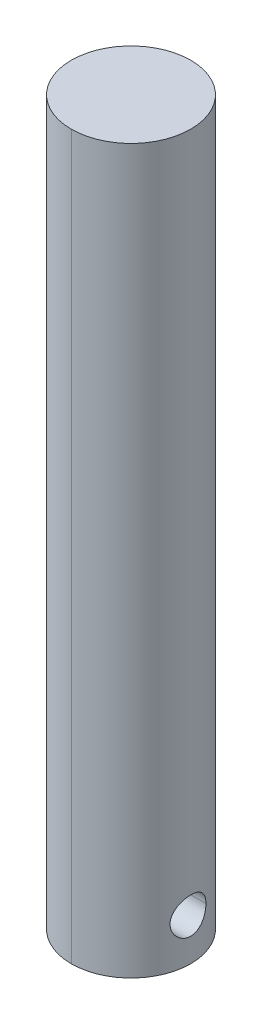
ISO-10303-21;
HEADER;
FILE_DESCRIPTION(('STEP AP214'),'2;1');
FILE_NAME('part.step','',(''),(''),'','','');
FILE_SCHEMA(('AUTOMOTIVE_DESIGN { 1 0 10303 214 1 1 1 1 }'));
ENDSEC;
DATA;
#1=APPLICATION_CONTEXT('core data for automotive mechanical design processes');
#2=APPLICATION_PROTOCOL_DEFINITION('international standard','automotive_design',2000,#1);
#3=PRODUCT_CONTEXT('',#1,'mechanical');
#4=PRODUCT('Part','Part','',(#3));
#5=PRODUCT_RELATED_PRODUCT_CATEGORY('part','',(#4));
#6=PRODUCT_DEFINITION_FORMATION('','',#4);
#7=PRODUCT_DEFINITION_CONTEXT('part definition',#1,'design');
#8=PRODUCT_DEFINITION('design','',#6,#7);
#9=PRODUCT_DEFINITION_SHAPE('','',#8);
#10=(LENGTH_UNIT() NAMED_UNIT(*) SI_UNIT(.MILLI.,.METRE.));
#11=(NAMED_UNIT(*) PLANE_ANGLE_UNIT() SI_UNIT($,.RADIAN.));
#12=(NAMED_UNIT(*) SI_UNIT($,.STERADIAN.) SOLID_ANGLE_UNIT());
#13=UNCERTAINTY_MEASURE_WITH_UNIT(LENGTH_MEASURE(1.E-05),#10,'distance_accuracy_value','');
#14=(GEOMETRIC_REPRESENTATION_CONTEXT(3) GLOBAL_UNCERTAINTY_ASSIGNED_CONTEXT((#13)) GLOBAL_UNIT_ASSIGNED_CONTEXT((#10,
#11,#12)) REPRESENTATION_CONTEXT('',''));
#15=CARTESIAN_POINT('',(0.,0.,0.));
#16=DIRECTION('',(0.,0.,1.));
#17=DIRECTION('',(1.,0.,0.));
#18=AXIS2_PLACEMENT_3D('',#15,#16,#17);
#19=CARTESIAN_POINT('',(-10.001,7.,0.));
#20=DIRECTION('',(1.,0.,0.));
#21=DIRECTION('',(0.,0.,-1.));
#22=AXIS2_PLACEMENT_3D('',#19,#20,#21);
#23=CYLINDRICAL_SURFACE('',#22,3.);
#24=DIRECTION('',(1.,0.,0.));
#25=VECTOR('',#24,1.);
#26=CARTESIAN_POINT('',(-10.001,7.,3.));
#27=LINE('',#26,#25);
#28=CARTESIAN_POINT('',(-9.53939201416946,7.,3.));
#29=VERTEX_POINT('',#28);
#30=CARTESIAN_POINT('',(9.53939201416946,7.,3.));
#31=VERTEX_POINT('',#30);
#32=EDGE_CURVE('E82',#29,#31,#27,.T.);
#33=ORIENTED_EDGE('',*,*,#32,.F.);
#34=CARTESIAN_POINT('',(-9.53939201416946,7.,3.));
#35=CARTESIAN_POINT('',(-9.53938054248207,7.08233552082269,3.00001027845728));
#36=CARTESIAN_POINT('',(-9.54045772064378,7.16466445506322,2.99661062684472));
#37=CARTESIAN_POINT('',(-9.54470412105986,7.32869395276546,2.98307142899347));
#38=CARTESIAN_POINT('',(-9.54787287296848,7.41039465332436,2.97293339805418));
#39=CARTESIAN_POINT('',(-9.55620668351003,7.57238491567317,2.94603140625045));
#40=CARTESIAN_POINT('',(-9.56136667250114,7.65267752404303,2.92928426957737));
#41=CARTESIAN_POINT('',(-9.57351626651178,7.81147584413423,2.88932853030395));
#42=CARTESIAN_POINT('',(-9.58050591937828,7.8899815090674,2.86611975872641));
#43=CARTESIAN_POINT('',(-9.60391637654137,8.12194938799015,2.78708584446024));
#44=CARTESIAN_POINT('',(-9.62279007830391,8.27206843883301,2.72181852542972));
#45=CARTESIAN_POINT('',(-9.66493213967819,8.55922604397904,2.56815043531276));
#46=CARTESIAN_POINT('',(-9.6882025429064,8.69625847076217,2.4797388992416));
#47=CARTESIAN_POINT('',(-9.73733650515374,8.95772298794783,2.27929879634442));
#48=CARTESIAN_POINT('',(-9.76325505469874,9.08168487406091,2.16666914746584));
#49=CARTESIAN_POINT('',(-9.81429628475077,9.30927361483876,1.92227736150433));
#50=CARTESIAN_POINT('',(-9.8394188301941,9.41289703386101,1.79051199848164));
#51=CARTESIAN_POINT('',(-9.88666477976534,9.59892686509456,1.50821997465697));
#52=CARTESIAN_POINT('',(-9.90871541546877,9.68085017978262,1.35736167401016));
#53=CARTESIAN_POINT('',(-9.94668940088144,9.81797700400293,1.04324233568303));
#54=CARTESIAN_POINT('',(-9.96261433032403,9.87318740336795,0.879984508687985));
#55=CARTESIAN_POINT('',(-9.98615279768398,9.953759551791,0.550649404820602));
#56=CARTESIAN_POINT('',(-9.99399098526792,9.97992970351762,0.384786253016204));
#57=CARTESIAN_POINT('',(-10.0012640407204,10.004234695146,0.0508471415689285));
#58=CARTESIAN_POINT('',(-10.0007004995012,10.0023748426782,-0.117228393125338));
#59=CARTESIAN_POINT('',(-9.99139205125586,9.97121417930856,-0.445143199271824));
#60=CARTESIAN_POINT('',(-9.98290831016512,9.94278930919189,-0.605074290763027));
#61=CARTESIAN_POINT('',(-9.95903027401822,9.86073673037451,-0.917780104370313));
#62=CARTESIAN_POINT('',(-9.94363561692558,9.80710770131733,-1.07055445110879));
#63=CARTESIAN_POINT('',(-9.90730429851782,9.67557555647525,-1.36669563173912));
#64=CARTESIAN_POINT('',(-9.88630511384915,9.59739671122391,-1.50993201207612));
#65=CARTESIAN_POINT('',(-9.84099249303647,9.41920281996559,-1.781531059161));
#66=CARTESIAN_POINT('',(-9.81667831471806,9.3191828810593,-1.9098903832325));
#67=CARTESIAN_POINT('',(-9.7662334714278,9.09561602381536,-2.15330901082205));
#68=CARTESIAN_POINT('',(-9.74006890899097,8.97131227247379,-2.26766702955975));
#69=CARTESIAN_POINT('',(-9.68968430229327,8.70500515314889,-2.47413538985067));
#70=CARTESIAN_POINT('',(-9.66546482675134,8.56299663927022,-2.5662392402618));
#71=CARTESIAN_POINT('',(-9.62154457591303,8.26343814310014,-2.72632814481701));
#72=CARTESIAN_POINT('',(-9.60189192491895,8.10574564081286,-2.79406012682263));
#73=CARTESIAN_POINT('',(-9.56991327306402,7.78055099203685,-2.90171772009404));
#74=CARTESIAN_POINT('',(-9.55757606951749,7.61306427857132,-2.94168586436072));
#75=CARTESIAN_POINT('',(-9.54628064650012,7.3700102218596,-2.97802407180159));
#76=CARTESIAN_POINT('',(-9.54370312550533,7.29621853164078,-2.98626405978017));
#77=CARTESIAN_POINT('',(-9.54025857223564,7.14829704180096,-2.99724711229708));
#78=CARTESIAN_POINT('',(-9.53938902493288,7.07416790067231,-2.99999825936538));
#79=CARTESIAN_POINT('',(-9.53939201416946,7.,-3.));
#80=B_SPLINE_CURVE_WITH_KNOTS('',3,(#34,#35,#36,#37,#38,#39,#40,#41,#42,#43,#44,#45,#46,#47,#48,
#49,#50,#51,#52,#53,#54,#55,#56,#57,#58,#59,#60,#61,#62,#63,#64,#65,#66,#67,#68,#69,#70,#71,#72,
#73,#74,#75,#76,#77,#78,#79),.UNSPECIFIED.,.F.,.F.,(4,2,2,2,2,2,2,2,2,2,2,2,2,2,2,2,2,2,2,2,2,2,
4),(0.,0.246918142439467,0.493780777706084,0.740019009623011,0.986263681482024,1.47813347402025,
1.97023245590779,2.47635119822766,2.98255536239033,3.4992281062007,4.01576751791672,
4.51753600864764,5.01920948804101,5.50490358251093,5.99062312360831,6.48200583350621,
6.9734987373917,7.48389234847122,7.99443465298715,8.51013494368214,9.02504345105574,
9.24774267716777,9.47011372732391),.UNSPECIFIED.);
#81=CARTESIAN_POINT('',(-9.53939201416946,7.,-3.));
#82=VERTEX_POINT('',#81);
#83=EDGE_CURVE('E11',#29,#82,#80,.T.);
#84=ORIENTED_EDGE('',*,*,#83,.T.);
#85=DIRECTION('',(1.,0.,0.));
#86=VECTOR('',#85,1.);
#87=CARTESIAN_POINT('',(-10.001,7.,-3.));
#88=LINE('',#87,#86);
#89=CARTESIAN_POINT('',(9.53939201416946,7.,-3.));
#90=VERTEX_POINT('',#89);
#91=EDGE_CURVE('E91',#82,#90,#88,.T.);
#92=ORIENTED_EDGE('',*,*,#91,.T.);
#93=CARTESIAN_POINT('',(9.53939201416946,7.,3.));
#94=CARTESIAN_POINT('',(9.53938054248207,7.08233552082269,3.00001027845728));
#95=CARTESIAN_POINT('',(9.54045772064378,7.16466445506322,2.99661062684472));
#96=CARTESIAN_POINT('',(9.54470412105986,7.32869395276546,2.98307142899347));
#97=CARTESIAN_POINT('',(9.54787287296848,7.41039465332436,2.97293339805418));
#98=CARTESIAN_POINT('',(9.55620668351003,7.57238491567317,2.94603140625045));
#99=CARTESIAN_POINT('',(9.56136667250114,7.65267752404303,2.92928426957737));
#100=CARTESIAN_POINT('',(9.57351626651178,7.81147584413423,2.88932853030395));
#101=CARTESIAN_POINT('',(9.58050591937828,7.8899815090674,2.86611975872641));
#102=CARTESIAN_POINT('',(9.60391637654137,8.12194938799015,2.78708584446024));
#103=CARTESIAN_POINT('',(9.62279007830391,8.27206843883301,2.72181852542972));
#104=CARTESIAN_POINT('',(9.66493213967819,8.55922604397904,2.56815043531276));
#105=CARTESIAN_POINT('',(9.6882025429064,8.69625847076217,2.4797388992416));
#106=CARTESIAN_POINT('',(9.73733650515374,8.95772298794783,2.27929879634442));
#107=CARTESIAN_POINT('',(9.76325505469874,9.08168487406091,2.16666914746584));
#108=CARTESIAN_POINT('',(9.81429628475077,9.30927361483876,1.92227736150433));
#109=CARTESIAN_POINT('',(9.8394188301941,9.41289703386101,1.79051199848164));
#110=CARTESIAN_POINT('',(9.88666477976534,9.59892686509456,1.50821997465697));
#111=CARTESIAN_POINT('',(9.90871541546877,9.68085017978262,1.35736167401016));
#112=CARTESIAN_POINT('',(9.94668940088144,9.81797700400293,1.04324233568303));
#113=CARTESIAN_POINT('',(9.96261433032403,9.87318740336795,0.879984508687985));
#114=CARTESIAN_POINT('',(9.98615279768398,9.953759551791,0.550649404820602));
#115=CARTESIAN_POINT('',(9.99399098526792,9.97992970351762,0.384786253016204));
#116=CARTESIAN_POINT('',(10.0012640407204,10.004234695146,0.0508471415689285));
#117=CARTESIAN_POINT('',(10.0007004995012,10.0023748426782,-0.117228393125338));
#118=CARTESIAN_POINT('',(9.99139205125586,9.97121417930856,-0.445143199271824));
#119=CARTESIAN_POINT('',(9.98290831016512,9.94278930919189,-0.605074290763027));
#120=CARTESIAN_POINT('',(9.95903027401822,9.86073673037451,-0.917780104370313));
#121=CARTESIAN_POINT('',(9.94363561692558,9.80710770131733,-1.07055445110879));
#122=CARTESIAN_POINT('',(9.90730429851782,9.67557555647525,-1.36669563173912));
#123=CARTESIAN_POINT('',(9.88630511384915,9.59739671122391,-1.50993201207612));
#124=CARTESIAN_POINT('',(9.84099249303647,9.41920281996559,-1.781531059161));
#125=CARTESIAN_POINT('',(9.81667831471806,9.3191828810593,-1.9098903832325));
#126=CARTESIAN_POINT('',(9.7662334714278,9.09561602381536,-2.15330901082205));
#127=CARTESIAN_POINT('',(9.74006890899097,8.97131227247379,-2.26766702955975));
#128=CARTESIAN_POINT('',(9.68968430229327,8.70500515314889,-2.47413538985067));
#129=CARTESIAN_POINT('',(9.66546482675134,8.56299663927022,-2.5662392402618));
#130=CARTESIAN_POINT('',(9.62154457591303,8.26343814310014,-2.72632814481701));
#131=CARTESIAN_POINT('',(9.60189192491895,8.10574564081286,-2.79406012682263));
#132=CARTESIAN_POINT('',(9.56991327306402,7.78055099203685,-2.90171772009404));
#133=CARTESIAN_POINT('',(9.55757606951749,7.61306427857132,-2.94168586436072));
#134=CARTESIAN_POINT('',(9.54628064650012,7.3700102218596,-2.97802407180159));
#135=CARTESIAN_POINT('',(9.54370312550533,7.29621853164078,-2.98626405978017));
#136=CARTESIAN_POINT('',(9.54025857223564,7.14829704180096,-2.99724711229708));
#137=CARTESIAN_POINT('',(9.53938902493288,7.07416790067231,-2.99999825936538));
#138=CARTESIAN_POINT('',(9.53939201416946,7.,-3.));
#139=B_SPLINE_CURVE_WITH_KNOTS('',3,(#93,#94,#95,#96,#97,#98,#99,#100,#101,#102,#103,#104,#105,
#106,#107,#108,#109,#110,#111,#112,#113,#114,#115,#116,#117,#118,#119,#120,#121,#122,#123,#124,
#125,#126,#127,#128,#129,#130,#131,#132,#133,#134,#135,#136,#137,#138),.UNSPECIFIED.,.F.,.F.,(4,
2,2,2,2,2,2,2,2,2,2,2,2,2,2,2,2,2,2,2,2,2,4),(0.,0.246918142439467,0.493780777706084,
0.740019009623011,0.986263681482024,1.47813347402025,1.97023245590779,2.47635119822766,
2.98255536239033,3.4992281062007,4.01576751791672,4.51753600864764,5.01920948804101,
5.50490358251093,5.99062312360831,6.48200583350621,6.9734987373917,7.48389234847122,
7.99443465298715,8.51013494368214,9.02504345105574,9.24774267716777,9.47011372732391),.UNSPECIFIED.);
#140=EDGE_CURVE('E83',#31,#90,#139,.T.);
#141=ORIENTED_EDGE('',*,*,#140,.F.);
#142=EDGE_LOOP('',(#33,#84,#92,#141));
#143=FACE_BOUND('',#142,.T.);
#144=ADVANCED_FACE('F16',(#143),#23,.F.);
#145=CARTESIAN_POINT('',(0.,0.,0.));
#146=DIRECTION('',(0.,1.,0.));
#147=DIRECTION('',(1.,0.,0.));
#148=AXIS2_PLACEMENT_3D('',#145,#146,#147);
#149=PLANE('',#148);
#150=CARTESIAN_POINT('',(0.,0.,0.));
#151=DIRECTION('',(0.,1.,0.));
#152=DIRECTION('',(0.,0.,1.));
#153=AXIS2_PLACEMENT_3D('',#150,#151,#152);
#154=CIRCLE('',#153,10.);
#155=CARTESIAN_POINT('',(0.,0.,-10.));
#156=VERTEX_POINT('',#155);
#157=CARTESIAN_POINT('',(0.,0.,10.));
#158=VERTEX_POINT('',#157);
#159=EDGE_CURVE('E32',#156,#158,#154,.T.);
#160=ORIENTED_EDGE('',*,*,#159,.F.);
#161=CARTESIAN_POINT('',(0.,0.,0.));
#162=DIRECTION('',(0.,1.,0.));
#163=DIRECTION('',(0.,0.,1.));
#164=AXIS2_PLACEMENT_3D('',#161,#162,#163);
#165=CIRCLE('',#164,10.);
#166=EDGE_CURVE('E279',#158,#156,#165,.T.);
#167=ORIENTED_EDGE('',*,*,#166,.F.);
#168=EDGE_LOOP('',(#160,#167));
#169=FACE_BOUND('',#168,.T.);
#170=ADVANCED_FACE('F135',(#169),#149,.F.);
#171=CARTESIAN_POINT('',(0.,121.,0.));
#172=DIRECTION('',(0.,1.,0.));
#173=DIRECTION('',(1.,0.,0.));
#174=AXIS2_PLACEMENT_3D('',#171,#172,#173);
#175=PLANE('',#174);
#176=CARTESIAN_POINT('',(0.,121.,0.));
#177=DIRECTION('',(0.,1.,0.));
#178=DIRECTION('',(0.,0.,1.));
#179=AXIS2_PLACEMENT_3D('',#176,#177,#178);
#180=CIRCLE('',#179,10.);
#181=CARTESIAN_POINT('',(0.,121.,-10.));
#182=VERTEX_POINT('',#181);
#183=CARTESIAN_POINT('',(0.,121.,10.));
#184=VERTEX_POINT('',#183);
#185=EDGE_CURVE('E285',#182,#184,#180,.T.);
#186=ORIENTED_EDGE('',*,*,#185,.T.);
#187=CARTESIAN_POINT('',(0.,121.,0.));
#188=DIRECTION('',(0.,1.,0.));
#189=DIRECTION('',(0.,0.,1.));
#190=AXIS2_PLACEMENT_3D('',#187,#188,#189);
#191=CIRCLE('',#190,10.);
#192=EDGE_CURVE('E102',#184,#182,#191,.T.);
#193=ORIENTED_EDGE('',*,*,#192,.T.);
#194=EDGE_LOOP('',(#186,#193));
#195=FACE_BOUND('',#194,.T.);
#196=ADVANCED_FACE('F123',(#195),#175,.T.);
#197=CARTESIAN_POINT('',(0.,121.,0.));
#198=DIRECTION('',(0.,-1.,0.));
#199=DIRECTION('',(0.,0.,-1.));
#200=AXIS2_PLACEMENT_3D('',#197,#198,#199);
#201=CYLINDRICAL_SURFACE('',#200,10.);
#202=CARTESIAN_POINT('',(-9.53939201416946,7.,-3.));
#203=CARTESIAN_POINT('',(-9.53938054248207,6.91766447917731,-3.00001027845728));
#204=CARTESIAN_POINT('',(-9.54045772064378,6.83533554493678,-2.99661062684472));
#205=CARTESIAN_POINT('',(-9.54470412105986,6.67130604723454,-2.98307142899347));
#206=CARTESIAN_POINT('',(-9.54787287296848,6.58960534667565,-2.97293339805418));
#207=CARTESIAN_POINT('',(-9.55620668351003,6.42761508432683,-2.94603140625045));
#208=CARTESIAN_POINT('',(-9.56136667250114,6.34732247595697,-2.92928426957737));
#209=CARTESIAN_POINT('',(-9.57351626651178,6.18852415586577,-2.88932853030395));
#210=CARTESIAN_POINT('',(-9.58050591937828,6.1100184909326,-2.86611975872641));
#211=CARTESIAN_POINT('',(-9.60391637654137,5.87805061200985,-2.78708584446024));
#212=CARTESIAN_POINT('',(-9.62279007830391,5.72793156116699,-2.72181852542972));
#213=CARTESIAN_POINT('',(-9.66493213967819,5.44077395602096,-2.56815043531276));
#214=CARTESIAN_POINT('',(-9.6882025429064,5.30374152923783,-2.4797388992416));
#215=CARTESIAN_POINT('',(-9.73733650515374,5.04227701205217,-2.27929879634442));
#216=CARTESIAN_POINT('',(-9.76325505469874,4.91831512593909,-2.16666914746584));
#217=CARTESIAN_POINT('',(-9.81429628475077,4.69072638516124,-1.92227736150433));
#218=CARTESIAN_POINT('',(-9.8394188301941,4.58710296613899,-1.79051199848164));
#219=CARTESIAN_POINT('',(-9.88666477976534,4.40107313490544,-1.50821997465697));
#220=CARTESIAN_POINT('',(-9.90871541546877,4.31914982021738,-1.35736167401016));
#221=CARTESIAN_POINT('',(-9.94668940088144,4.18202299599707,-1.04324233568303));
#222=CARTESIAN_POINT('',(-9.96261433032403,4.12681259663205,-0.879984508687984));
#223=CARTESIAN_POINT('',(-9.98615279768398,4.046240448209,-0.550649404820601));
#224=CARTESIAN_POINT('',(-9.99399098526792,4.02007029648238,-0.384786253016203));
#225=CARTESIAN_POINT('',(-10.0012640407204,3.99576530485396,-0.0508471415689276));
#226=CARTESIAN_POINT('',(-10.0007004995012,3.99762515732182,0.117228393125339));
#227=CARTESIAN_POINT('',(-9.99139205125586,4.02878582069144,0.445143199271825));
#228=CARTESIAN_POINT('',(-9.98290831016512,4.05721069080811,0.605074290763028));
#229=CARTESIAN_POINT('',(-9.95903027401822,4.13926326962549,0.917780104370314));
#230=CARTESIAN_POINT('',(-9.94363561692558,4.19289229868267,1.07055445110879));
#231=CARTESIAN_POINT('',(-9.90730429851782,4.32442444352475,1.36669563173912));
#232=CARTESIAN_POINT('',(-9.88630511384915,4.4026032887761,1.50993201207613));
#233=CARTESIAN_POINT('',(-9.84099249303647,4.58079718003441,1.781531059161));
#234=CARTESIAN_POINT('',(-9.81667831471806,4.6808171189407,1.90989038323251));
#235=CARTESIAN_POINT('',(-9.7662334714278,4.90438397618464,2.15330901082205));
#236=CARTESIAN_POINT('',(-9.74006890899097,5.02868772752621,2.26766702955975));
#237=CARTESIAN_POINT('',(-9.68968430229327,5.29499484685111,2.47413538985067));
#238=CARTESIAN_POINT('',(-9.66546482675134,5.43700336072978,2.5662392402618));
#239=CARTESIAN_POINT('',(-9.62154457591303,5.73656185689986,2.72632814481701));
#240=CARTESIAN_POINT('',(-9.60189192491895,5.89425435918714,2.79406012682263));
#241=CARTESIAN_POINT('',(-9.56991327306402,6.21944900796315,2.90171772009404));
#242=CARTESIAN_POINT('',(-9.55757606951749,6.38693572142869,2.94168586436072));
#243=CARTESIAN_POINT('',(-9.54628064650012,6.6299897781404,2.97802407180159));
#244=CARTESIAN_POINT('',(-9.54370312550533,6.70378146835922,2.98626405978017));
#245=CARTESIAN_POINT('',(-9.54025857223564,6.85170295819904,2.99724711229708));
#246=CARTESIAN_POINT('',(-9.53938902493288,6.92583209932769,2.99999825936538));
#247=CARTESIAN_POINT('',(-9.53939201416946,7.,3.));
#248=B_SPLINE_CURVE_WITH_KNOTS('',3,(#202,#203,#204,#205,#206,#207,#208,#209,#210,#211,#212,
#213,#214,#215,#216,#217,#218,#219,#220,#221,#222,#223,#224,#225,#226,#227,#228,#229,#230,#231,
#232,#233,#234,#235,#236,#237,#238,#239,#240,#241,#242,#243,#244,#245,#246,#247),.UNSPECIFIED.,
.F.,.F.,(4,2,2,2,2,2,2,2,2,2,2,2,2,2,2,2,2,2,2,2,2,2,4),(0.,0.246918142439467,0.493780777706084,
0.740019009623011,0.986263681482025,1.47813347402025,1.97023245590779,2.47635119822766,
2.98255536239033,3.4992281062007,4.01576751791672,4.51753600864764,5.01920948804101,
5.50490358251093,5.99062312360831,6.48200583350621,6.9734987373917,7.48389234847122,
7.99443465298715,8.51013494368214,9.02504345105574,9.24774267716778,9.47011372732391),.UNSPECIFIED.);
#249=EDGE_CURVE('E20',#82,#29,#248,.T.);
#250=ORIENTED_EDGE('',*,*,#249,.F.);
#251=ORIENTED_EDGE('',*,*,#83,.F.);
#252=EDGE_LOOP('',(#250,#251));
#253=FACE_BOUND('',#252,.T.);
#254=DIRECTION('',(0.,-1.,0.));
#255=VECTOR('',#254,1.);
#256=CARTESIAN_POINT('',(0.,121.,10.));
#257=LINE('',#256,#255);
#258=EDGE_CURVE('E276',#184,#158,#257,.T.);
#259=ORIENTED_EDGE('',*,*,#258,.F.);
#260=ORIENTED_EDGE('',*,*,#185,.F.);
#261=DIRECTION('',(0.,-1.,0.));
#262=VECTOR('',#261,1.);
#263=CARTESIAN_POINT('',(0.,121.,-10.));
#264=LINE('',#263,#262);
#265=EDGE_CURVE('E280',#182,#156,#264,.T.);
#266=ORIENTED_EDGE('',*,*,#265,.T.);
#267=ORIENTED_EDGE('',*,*,#159,.T.);
#268=EDGE_LOOP('',(#259,#260,#266,#267));
#269=FACE_BOUND('',#268,.T.);
#270=ADVANCED_FACE('F78',(#253,#269),#201,.T.);
#271=CARTESIAN_POINT('',(0.,121.,0.));
#272=DIRECTION('',(0.,-1.,0.));
#273=DIRECTION('',(0.,0.,-1.));
#274=AXIS2_PLACEMENT_3D('',#271,#272,#273);
#275=CYLINDRICAL_SURFACE('',#274,10.);
#276=CARTESIAN_POINT('',(9.53939201416946,7.,-3.));
#277=CARTESIAN_POINT('',(9.53938054248207,6.91766447917731,-3.00001027845728));
#278=CARTESIAN_POINT('',(9.54045772064378,6.83533554493678,-2.99661062684472));
#279=CARTESIAN_POINT('',(9.54470412105986,6.67130604723454,-2.98307142899347));
#280=CARTESIAN_POINT('',(9.54787287296848,6.58960534667565,-2.97293339805418));
#281=CARTESIAN_POINT('',(9.55620668351003,6.42761508432683,-2.94603140625045));
#282=CARTESIAN_POINT('',(9.56136667250114,6.34732247595697,-2.92928426957737));
#283=CARTESIAN_POINT('',(9.57351626651178,6.18852415586577,-2.88932853030395));
#284=CARTESIAN_POINT('',(9.58050591937828,6.1100184909326,-2.86611975872641));
#285=CARTESIAN_POINT('',(9.60391637654137,5.87805061200985,-2.78708584446024));
#286=CARTESIAN_POINT('',(9.62279007830391,5.72793156116699,-2.72181852542972));
#287=CARTESIAN_POINT('',(9.66493213967819,5.44077395602096,-2.56815043531276));
#288=CARTESIAN_POINT('',(9.6882025429064,5.30374152923783,-2.4797388992416));
#289=CARTESIAN_POINT('',(9.73733650515374,5.04227701205217,-2.27929879634442));
#290=CARTESIAN_POINT('',(9.76325505469874,4.91831512593909,-2.16666914746584));
#291=CARTESIAN_POINT('',(9.81429628475077,4.69072638516124,-1.92227736150433));
#292=CARTESIAN_POINT('',(9.8394188301941,4.58710296613899,-1.79051199848164));
#293=CARTESIAN_POINT('',(9.88666477976534,4.40107313490544,-1.50821997465697));
#294=CARTESIAN_POINT('',(9.90871541546877,4.31914982021738,-1.35736167401016));
#295=CARTESIAN_POINT('',(9.94668940088144,4.18202299599707,-1.04324233568303));
#296=CARTESIAN_POINT('',(9.96261433032403,4.12681259663205,-0.879984508687984));
#297=CARTESIAN_POINT('',(9.98615279768398,4.046240448209,-0.550649404820601));
#298=CARTESIAN_POINT('',(9.99399098526792,4.02007029648238,-0.384786253016203));
#299=CARTESIAN_POINT('',(10.0012640407204,3.99576530485396,-0.0508471415689276));
#300=CARTESIAN_POINT('',(10.0007004995012,3.99762515732182,0.117228393125339));
#301=CARTESIAN_POINT('',(9.99139205125586,4.02878582069144,0.445143199271825));
#302=CARTESIAN_POINT('',(9.98290831016512,4.05721069080811,0.605074290763028));
#303=CARTESIAN_POINT('',(9.95903027401822,4.13926326962549,0.917780104370314));
#304=CARTESIAN_POINT('',(9.94363561692558,4.19289229868267,1.07055445110879));
#305=CARTESIAN_POINT('',(9.90730429851782,4.32442444352475,1.36669563173912));
#306=CARTESIAN_POINT('',(9.88630511384915,4.4026032887761,1.50993201207613));
#307=CARTESIAN_POINT('',(9.84099249303647,4.58079718003441,1.781531059161));
#308=CARTESIAN_POINT('',(9.81667831471806,4.6808171189407,1.90989038323251));
#309=CARTESIAN_POINT('',(9.7662334714278,4.90438397618464,2.15330901082205));
#310=CARTESIAN_POINT('',(9.74006890899097,5.02868772752621,2.26766702955975));
#311=CARTESIAN_POINT('',(9.68968430229327,5.29499484685111,2.47413538985067));
#312=CARTESIAN_POINT('',(9.66546482675134,5.43700336072978,2.5662392402618));
#313=CARTESIAN_POINT('',(9.62154457591303,5.73656185689986,2.72632814481701));
#314=CARTESIAN_POINT('',(9.60189192491895,5.89425435918714,2.79406012682263));
#315=CARTESIAN_POINT('',(9.56991327306402,6.21944900796315,2.90171772009404));
#316=CARTESIAN_POINT('',(9.55757606951749,6.38693572142869,2.94168586436072));
#317=CARTESIAN_POINT('',(9.54628064650012,6.6299897781404,2.97802407180159));
#318=CARTESIAN_POINT('',(9.54370312550533,6.70378146835922,2.98626405978017));
#319=CARTESIAN_POINT('',(9.54025857223564,6.85170295819904,2.99724711229708));
#320=CARTESIAN_POINT('',(9.53938902493288,6.92583209932769,2.99999825936538));
#321=CARTESIAN_POINT('',(9.53939201416946,7.,3.));
#322=B_SPLINE_CURVE_WITH_KNOTS('',3,(#276,#277,#278,#279,#280,#281,#282,#283,#284,#285,#286,
#287,#288,#289,#290,#291,#292,#293,#294,#295,#296,#297,#298,#299,#300,#301,#302,#303,#304,#305,
#306,#307,#308,#309,#310,#311,#312,#313,#314,#315,#316,#317,#318,#319,#320,#321),.UNSPECIFIED.,
.F.,.F.,(4,2,2,2,2,2,2,2,2,2,2,2,2,2,2,2,2,2,2,2,2,2,4),(0.,0.246918142439467,0.493780777706084,
0.740019009623011,0.986263681482025,1.47813347402025,1.97023245590779,2.47635119822766,
2.98255536239033,3.4992281062007,4.01576751791672,4.51753600864764,5.01920948804101,
5.50490358251093,5.99062312360831,6.48200583350621,6.9734987373917,7.48389234847122,
7.99443465298715,8.51013494368214,9.02504345105574,9.24774267716778,9.47011372732391),.UNSPECIFIED.);
#323=EDGE_CURVE('E88',#90,#31,#322,.T.);
#324=ORIENTED_EDGE('',*,*,#323,.T.);
#325=ORIENTED_EDGE('',*,*,#140,.T.);
#326=EDGE_LOOP('',(#324,#325));
#327=FACE_BOUND('',#326,.T.);
#328=ORIENTED_EDGE('',*,*,#192,.F.);
#329=ORIENTED_EDGE('',*,*,#258,.T.);
#330=ORIENTED_EDGE('',*,*,#166,.T.);
#331=ORIENTED_EDGE('',*,*,#265,.F.);
#332=EDGE_LOOP('',(#328,#329,#330,#331));
#333=FACE_BOUND('',#332,.T.);
#334=ADVANCED_FACE('F122',(#327,#333),#275,.T.);
#335=CARTESIAN_POINT('',(-10.001,7.,0.));
#336=DIRECTION('',(1.,0.,0.));
#337=DIRECTION('',(0.,0.,-1.));
#338=AXIS2_PLACEMENT_3D('',#335,#336,#337);
#339=CYLINDRICAL_SURFACE('',#338,3.);
#340=ORIENTED_EDGE('',*,*,#249,.T.);
#341=ORIENTED_EDGE('',*,*,#32,.T.);
#342=ORIENTED_EDGE('',*,*,#323,.F.);
#343=ORIENTED_EDGE('',*,*,#91,.F.);
#344=EDGE_LOOP('',(#340,#341,#342,#343));
#345=FACE_BOUND('',#344,.T.);
#346=ADVANCED_FACE('F90',(#345),#339,.F.);
#347=CLOSED_SHELL('',(#144,#170,#196,#270,#334,#346));
#348=MANIFOLD_SOLID_BREP('B1',#347);
#349=ADVANCED_BREP_SHAPE_REPRESENTATION('',(#18,#348),#14);
#350=SHAPE_DEFINITION_REPRESENTATION(#9,#349);
ENDSEC;
END-ISO-10303-21;
